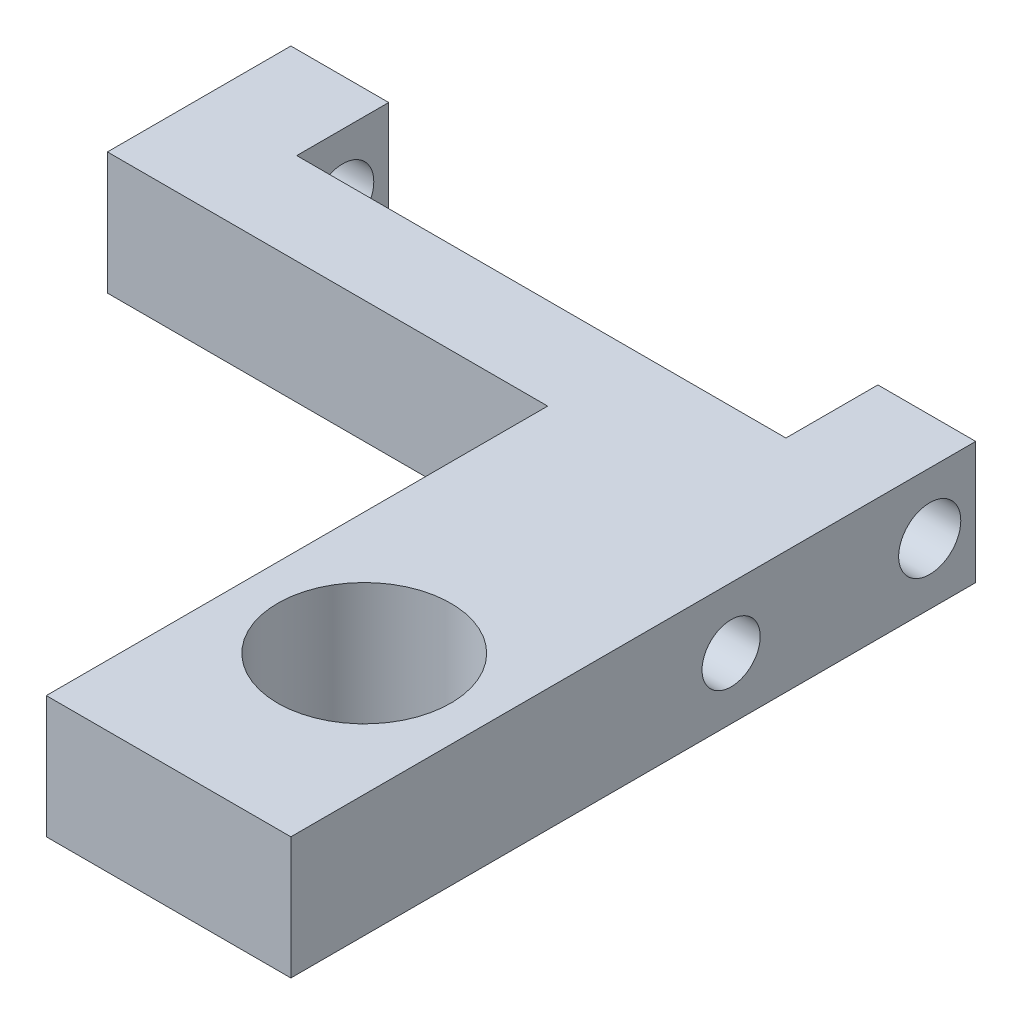
ISO-10303-21;
HEADER;
FILE_DESCRIPTION(('STEP AP214'),'2;1');
FILE_NAME('part.step','',(''),(''),'','','');
FILE_SCHEMA(('AUTOMOTIVE_DESIGN { 1 0 10303 214 1 1 1 1 }'));
ENDSEC;
DATA;
#1=APPLICATION_CONTEXT('core data for automotive mechanical design processes');
#2=APPLICATION_PROTOCOL_DEFINITION('international standard','automotive_design',2000,#1);
#3=PRODUCT_CONTEXT('',#1,'mechanical');
#4=PRODUCT('Part','Part','',(#3));
#5=PRODUCT_RELATED_PRODUCT_CATEGORY('part','',(#4));
#6=PRODUCT_DEFINITION_FORMATION('','',#4);
#7=PRODUCT_DEFINITION_CONTEXT('part definition',#1,'design');
#8=PRODUCT_DEFINITION('design','',#6,#7);
#9=PRODUCT_DEFINITION_SHAPE('','',#8);
#10=(LENGTH_UNIT() NAMED_UNIT(*) SI_UNIT(.MILLI.,.METRE.));
#11=(NAMED_UNIT(*) PLANE_ANGLE_UNIT() SI_UNIT($,.RADIAN.));
#12=(NAMED_UNIT(*) SI_UNIT($,.STERADIAN.) SOLID_ANGLE_UNIT());
#13=UNCERTAINTY_MEASURE_WITH_UNIT(LENGTH_MEASURE(1.E-05),#10,'distance_accuracy_value','');
#14=(GEOMETRIC_REPRESENTATION_CONTEXT(3) GLOBAL_UNCERTAINTY_ASSIGNED_CONTEXT((#13)) GLOBAL_UNIT_ASSIGNED_CONTEXT((#10,
#11,#12)) REPRESENTATION_CONTEXT('',''));
#15=CARTESIAN_POINT('',(0.,0.,0.));
#16=DIRECTION('',(0.,0.,1.));
#17=DIRECTION('',(1.,0.,0.));
#18=AXIS2_PLACEMENT_3D('',#15,#16,#17);
#19=CARTESIAN_POINT('',(-8.89,3.175,-8.89));
#20=DIRECTION('',(0.,0.,1.));
#21=DIRECTION('',(1.,0.,0.));
#22=AXIS2_PLACEMENT_3D('',#19,#20,#21);
#23=PLANE('',#22);
#24=DIRECTION('',(0.,-1.,0.));
#25=VECTOR('',#24,1.);
#26=CARTESIAN_POINT('',(6.34999999999999,3.175,-8.89));
#27=LINE('',#26,#25);
#28=CARTESIAN_POINT('',(6.34999999999999,3.175,-8.89));
#29=VERTEX_POINT('',#28);
#30=CARTESIAN_POINT('',(6.34999999999999,0.,-8.89));
#31=VERTEX_POINT('',#30);
#32=EDGE_CURVE('E173',#29,#31,#27,.T.);
#33=ORIENTED_EDGE('',*,*,#32,.F.);
#34=DIRECTION('',(-1.,0.,0.));
#35=VECTOR('',#34,1.);
#36=CARTESIAN_POINT('',(-8.89,3.175,-8.89));
#37=LINE('',#36,#35);
#38=CARTESIAN_POINT('',(8.89,3.175,-8.89));
#39=VERTEX_POINT('',#38);
#40=EDGE_CURVE('E185',#39,#29,#37,.T.);
#41=ORIENTED_EDGE('',*,*,#40,.F.);
#42=DIRECTION('',(0.,-1.,0.));
#43=VECTOR('',#42,1.);
#44=CARTESIAN_POINT('',(8.89,3.175,-8.89));
#45=LINE('',#44,#43);
#46=CARTESIAN_POINT('',(8.89,0.,-8.89));
#47=VERTEX_POINT('',#46);
#48=EDGE_CURVE('E208',#39,#47,#45,.T.);
#49=ORIENTED_EDGE('',*,*,#48,.T.);
#50=DIRECTION('',(-1.,0.,0.));
#51=VECTOR('',#50,1.);
#52=CARTESIAN_POINT('',(-8.89,0.,-8.89));
#53=LINE('',#52,#51);
#54=EDGE_CURVE('E197',#47,#31,#53,.T.);
#55=ORIENTED_EDGE('',*,*,#54,.T.);
#56=EDGE_LOOP('',(#33,#41,#49,#55));
#57=FACE_BOUND('',#56,.T.);
#58=ADVANCED_FACE('F35',(#57),#23,.F.);
#59=CARTESIAN_POINT('',(8.89,3.175,8.89));
#60=DIRECTION('',(-1.,0.,0.));
#61=DIRECTION('',(0.,0.,1.));
#62=AXIS2_PLACEMENT_3D('',#59,#60,#61);
#63=PLANE('',#62);
#64=CARTESIAN_POINT('',(8.89,1.5875,-2.54));
#65=DIRECTION('',(1.,0.,0.));
#66=DIRECTION('',(0.,0.,-1.));
#67=AXIS2_PLACEMENT_3D('',#64,#65,#66);
#68=CIRCLE('',#67,0.755649999999988);
#69=CARTESIAN_POINT('',(8.89,1.5875,-3.29564999999999));
#70=VERTEX_POINT('',#69);
#71=EDGE_CURVE('E142',#70,#70,#68,.T.);
#72=ORIENTED_EDGE('',*,*,#71,.F.);
#73=EDGE_LOOP('',(#72));
#74=FACE_BOUND('',#73,.T.);
#75=CARTESIAN_POINT('',(8.89,1.5875,-7.6962));
#76=DIRECTION('',(1.,0.,0.));
#77=DIRECTION('',(0.,0.,-1.));
#78=AXIS2_PLACEMENT_3D('',#75,#76,#77);
#79=CIRCLE('',#78,0.806449999999998);
#80=CARTESIAN_POINT('',(8.89,1.5875,-8.50265));
#81=VERTEX_POINT('',#80);
#82=EDGE_CURVE('E145',#81,#81,#79,.T.);
#83=ORIENTED_EDGE('',*,*,#82,.F.);
#84=EDGE_LOOP('',(#83));
#85=FACE_BOUND('',#84,.T.);
#86=DIRECTION('',(0.,0.,-1.));
#87=VECTOR('',#86,1.);
#88=CARTESIAN_POINT('',(8.89,0.,8.89));
#89=LINE('',#88,#87);
#90=CARTESIAN_POINT('',(8.89,0.,8.89));
#91=VERTEX_POINT('',#90);
#92=EDGE_CURVE('E180',#91,#47,#89,.T.);
#93=ORIENTED_EDGE('',*,*,#92,.T.);
#94=ORIENTED_EDGE('',*,*,#48,.F.);
#95=DIRECTION('',(0.,0.,-1.));
#96=VECTOR('',#95,1.);
#97=CARTESIAN_POINT('',(8.89,3.175,8.89));
#98=LINE('',#97,#96);
#99=CARTESIAN_POINT('',(8.89,3.175,8.89));
#100=VERTEX_POINT('',#99);
#101=EDGE_CURVE('E181',#100,#39,#98,.T.);
#102=ORIENTED_EDGE('',*,*,#101,.F.);
#103=DIRECTION('',(0.,-1.,0.));
#104=VECTOR('',#103,1.);
#105=CARTESIAN_POINT('',(8.89,3.175,8.89));
#106=LINE('',#105,#104);
#107=EDGE_CURVE('E193',#100,#91,#106,.T.);
#108=ORIENTED_EDGE('',*,*,#107,.T.);
#109=EDGE_LOOP('',(#93,#94,#102,#108));
#110=FACE_BOUND('',#109,.T.);
#111=ADVANCED_FACE('F37',(#74,#85,#110),#63,.F.);
#112=CARTESIAN_POINT('',(-6.35,3.175,-8.89));
#113=VERTEX_POINT('',#112);
#114=CARTESIAN_POINT('',(-8.89,3.175,-8.89));
#115=VERTEX_POINT('',#114);
#116=EDGE_CURVE('E184',#113,#115,#37,.T.);
#117=ORIENTED_EDGE('',*,*,#116,.F.);
#118=DIRECTION('',(0.,-1.,0.));
#119=VECTOR('',#118,1.);
#120=CARTESIAN_POINT('',(-6.35,3.175,-8.89));
#121=LINE('',#120,#119);
#122=CARTESIAN_POINT('',(-6.35,0.,-8.89));
#123=VERTEX_POINT('',#122);
#124=EDGE_CURVE('E177',#113,#123,#121,.T.);
#125=ORIENTED_EDGE('',*,*,#124,.T.);
#126=CARTESIAN_POINT('',(-8.89,0.,-8.89));
#127=VERTEX_POINT('',#126);
#128=EDGE_CURVE('E196',#123,#127,#53,.T.);
#129=ORIENTED_EDGE('',*,*,#128,.T.);
#130=DIRECTION('',(0.,-1.,0.));
#131=VECTOR('',#130,1.);
#132=CARTESIAN_POINT('',(-8.89,3.175,-8.89));
#133=LINE('',#132,#131);
#134=EDGE_CURVE('E205',#115,#127,#133,.T.);
#135=ORIENTED_EDGE('',*,*,#134,.F.);
#136=EDGE_LOOP('',(#117,#125,#129,#135));
#137=FACE_BOUND('',#136,.T.);
#138=ADVANCED_FACE('F243',(#137),#23,.F.);
#139=CARTESIAN_POINT('',(-8.89,3.175,8.89));
#140=DIRECTION('',(1.,0.,0.));
#141=DIRECTION('',(0.,0.,-1.));
#142=AXIS2_PLACEMENT_3D('',#139,#140,#141);
#143=PLANE('',#142);
#144=CARTESIAN_POINT('',(-8.89,1.5875,-7.6962));
#145=DIRECTION('',(1.,0.,0.));
#146=DIRECTION('',(0.,0.,-1.));
#147=AXIS2_PLACEMENT_3D('',#144,#145,#146);
#148=CIRCLE('',#147,0.806449999999995);
#149=CARTESIAN_POINT('',(-8.89,1.5875,-8.50264999999999));
#150=VERTEX_POINT('',#149);
#151=EDGE_CURVE('E148',#150,#150,#148,.T.);
#152=ORIENTED_EDGE('',*,*,#151,.T.);
#153=EDGE_LOOP('',(#152));
#154=FACE_BOUND('',#153,.T.);
#155=DIRECTION('',(0.,0.,1.));
#156=VECTOR('',#155,1.);
#157=CARTESIAN_POINT('',(-8.89,0.,8.89));
#158=LINE('',#157,#156);
#159=CARTESIAN_POINT('',(-8.89,0.,-4.1275));
#160=VERTEX_POINT('',#159);
#161=EDGE_CURVE('E200',#127,#160,#158,.T.);
#162=ORIENTED_EDGE('',*,*,#161,.T.);
#163=DIRECTION('',(0.,1.,0.));
#164=VECTOR('',#163,1.);
#165=CARTESIAN_POINT('',(-8.89,3.175,-4.1275));
#166=LINE('',#165,#164);
#167=CARTESIAN_POINT('',(-8.89,3.175,-4.1275));
#168=VERTEX_POINT('',#167);
#169=EDGE_CURVE('E52',#160,#168,#166,.T.);
#170=ORIENTED_EDGE('',*,*,#169,.T.);
#171=DIRECTION('',(0.,0.,1.));
#172=VECTOR('',#171,1.);
#173=CARTESIAN_POINT('',(-8.89,3.175,8.89));
#174=LINE('',#173,#172);
#175=EDGE_CURVE('E188',#115,#168,#174,.T.);
#176=ORIENTED_EDGE('',*,*,#175,.F.);
#177=ORIENTED_EDGE('',*,*,#134,.T.);
#178=EDGE_LOOP('',(#162,#170,#176,#177));
#179=FACE_BOUND('',#178,.T.);
#180=ADVANCED_FACE('F238',(#154,#179),#143,.F.);
#181=CARTESIAN_POINT('',(-8.89,3.175,8.89));
#182=DIRECTION('',(0.,0.,-1.));
#183=DIRECTION('',(-1.,0.,0.));
#184=AXIS2_PLACEMENT_3D('',#181,#182,#183);
#185=PLANE('',#184);
#186=DIRECTION('',(1.,0.,0.));
#187=VECTOR('',#186,1.);
#188=CARTESIAN_POINT('',(-8.89,3.175,8.89));
#189=LINE('',#188,#187);
#190=CARTESIAN_POINT('',(2.54,3.175,8.89));
#191=VERTEX_POINT('',#190);
#192=EDGE_CURVE('E191',#191,#100,#189,.T.);
#193=ORIENTED_EDGE('',*,*,#192,.F.);
#194=DIRECTION('',(0.,-1.,0.));
#195=VECTOR('',#194,1.);
#196=CARTESIAN_POINT('',(2.54,3.175,8.89));
#197=LINE('',#196,#195);
#198=CARTESIAN_POINT('',(2.54,0.,8.89));
#199=VERTEX_POINT('',#198);
#200=EDGE_CURVE('E139',#191,#199,#197,.T.);
#201=ORIENTED_EDGE('',*,*,#200,.T.);
#202=DIRECTION('',(1.,0.,0.));
#203=VECTOR('',#202,1.);
#204=CARTESIAN_POINT('',(-8.89,0.,8.89));
#205=LINE('',#204,#203);
#206=EDGE_CURVE('E133',#199,#91,#205,.T.);
#207=ORIENTED_EDGE('',*,*,#206,.T.);
#208=ORIENTED_EDGE('',*,*,#107,.F.);
#209=EDGE_LOOP('',(#193,#201,#207,#208));
#210=FACE_BOUND('',#209,.T.);
#211=ADVANCED_FACE('F233',(#210),#185,.F.);
#212=CARTESIAN_POINT('',(0.,3.175,0.));
#213=DIRECTION('',(0.,-1.,0.));
#214=DIRECTION('',(0.,0.,-1.));
#215=AXIS2_PLACEMENT_3D('',#212,#213,#214);
#216=PLANE('',#215);
#217=CARTESIAN_POINT('',(5.715,3.175,3.81));
#218=DIRECTION('',(0.,1.,0.));
#219=DIRECTION('',(0.,0.,1.));
#220=AXIS2_PLACEMENT_3D('',#217,#218,#219);
#221=CIRCLE('',#220,2.24789999999999);
#222=CARTESIAN_POINT('',(5.715,3.175,6.05789999999999));
#223=VERTEX_POINT('',#222);
#224=EDGE_CURVE('E155',#223,#223,#221,.T.);
#225=ORIENTED_EDGE('',*,*,#224,.F.);
#226=EDGE_LOOP('',(#225));
#227=FACE_BOUND('',#226,.T.);
#228=DIRECTION('',(-1.,0.,0.));
#229=VECTOR('',#228,1.);
#230=CARTESIAN_POINT('',(2.54,3.175,-4.1275));
#231=LINE('',#230,#229);
#232=CARTESIAN_POINT('',(2.54,3.175,-4.1275));
#233=VERTEX_POINT('',#232);
#234=EDGE_CURVE('E134',#233,#168,#231,.T.);
#235=ORIENTED_EDGE('',*,*,#234,.F.);
#236=DIRECTION('',(0.,0.,-1.));
#237=VECTOR('',#236,1.);
#238=CARTESIAN_POINT('',(2.54,3.175,-4.1275));
#239=LINE('',#238,#237);
#240=EDGE_CURVE('E120',#191,#233,#239,.T.);
#241=ORIENTED_EDGE('',*,*,#240,.F.);
#242=ORIENTED_EDGE('',*,*,#192,.T.);
#243=ORIENTED_EDGE('',*,*,#101,.T.);
#244=ORIENTED_EDGE('',*,*,#40,.T.);
#245=DIRECTION('',(0.,0.,1.));
#246=VECTOR('',#245,1.);
#247=CARTESIAN_POINT('',(6.34999999999999,3.175,-11.2776));
#248=LINE('',#247,#246);
#249=CARTESIAN_POINT('',(6.34999999999999,3.175,-6.5024));
#250=VERTEX_POINT('',#249);
#251=EDGE_CURVE('E166',#29,#250,#248,.T.);
#252=ORIENTED_EDGE('',*,*,#251,.T.);
#253=DIRECTION('',(1.,0.,0.));
#254=VECTOR('',#253,1.);
#255=CARTESIAN_POINT('',(-6.35,3.175,-6.5024));
#256=LINE('',#255,#254);
#257=CARTESIAN_POINT('',(-6.35,3.175,-6.5024));
#258=VERTEX_POINT('',#257);
#259=EDGE_CURVE('E168',#258,#250,#256,.T.);
#260=ORIENTED_EDGE('',*,*,#259,.F.);
#261=DIRECTION('',(0.,0.,1.));
#262=VECTOR('',#261,1.);
#263=CARTESIAN_POINT('',(-6.35,3.175,-11.2776));
#264=LINE('',#263,#262);
#265=EDGE_CURVE('E161',#113,#258,#264,.T.);
#266=ORIENTED_EDGE('',*,*,#265,.F.);
#267=ORIENTED_EDGE('',*,*,#116,.T.);
#268=ORIENTED_EDGE('',*,*,#175,.T.);
#269=EDGE_LOOP('',(#235,#241,#242,#243,#244,#252,#260,#266,#267,#268));
#270=FACE_BOUND('',#269,.T.);
#271=ADVANCED_FACE('F235',(#227,#270),#216,.F.);
#272=CARTESIAN_POINT('',(0.,0.,0.));
#273=DIRECTION('',(0.,-1.,0.));
#274=DIRECTION('',(0.,0.,-1.));
#275=AXIS2_PLACEMENT_3D('',#272,#273,#274);
#276=PLANE('',#275);
#277=DIRECTION('',(0.,0.,-1.));
#278=VECTOR('',#277,1.);
#279=CARTESIAN_POINT('',(2.54,0.,-4.1275));
#280=LINE('',#279,#278);
#281=CARTESIAN_POINT('',(2.54,0.,-4.1275));
#282=VERTEX_POINT('',#281);
#283=EDGE_CURVE('E117',#199,#282,#280,.T.);
#284=ORIENTED_EDGE('',*,*,#283,.T.);
#285=DIRECTION('',(-1.,0.,0.));
#286=VECTOR('',#285,1.);
#287=CARTESIAN_POINT('',(2.54,0.,-4.1275));
#288=LINE('',#287,#286);
#289=EDGE_CURVE('E122',#282,#160,#288,.T.);
#290=ORIENTED_EDGE('',*,*,#289,.T.);
#291=ORIENTED_EDGE('',*,*,#161,.F.);
#292=ORIENTED_EDGE('',*,*,#128,.F.);
#293=DIRECTION('',(0.,0.,-1.));
#294=VECTOR('',#293,1.);
#295=CARTESIAN_POINT('',(-6.35,0.,0.));
#296=LINE('',#295,#294);
#297=CARTESIAN_POINT('',(-6.35,0.,-6.5024));
#298=VERTEX_POINT('',#297);
#299=EDGE_CURVE('E11',#298,#123,#296,.T.);
#300=ORIENTED_EDGE('',*,*,#299,.F.);
#301=DIRECTION('',(1.,0.,0.));
#302=VECTOR('',#301,1.);
#303=CARTESIAN_POINT('',(-6.35,0.,-6.5024));
#304=LINE('',#303,#302);
#305=CARTESIAN_POINT('',(6.34999999999999,0.,-6.5024));
#306=VERTEX_POINT('',#305);
#307=EDGE_CURVE('E162',#298,#306,#304,.T.);
#308=ORIENTED_EDGE('',*,*,#307,.T.);
#309=DIRECTION('',(0.,0.,-1.));
#310=VECTOR('',#309,1.);
#311=CARTESIAN_POINT('',(6.34999999999999,0.,0.));
#312=LINE('',#311,#310);
#313=EDGE_CURVE('E44',#306,#31,#312,.T.);
#314=ORIENTED_EDGE('',*,*,#313,.T.);
#315=ORIENTED_EDGE('',*,*,#54,.F.);
#316=ORIENTED_EDGE('',*,*,#92,.F.);
#317=ORIENTED_EDGE('',*,*,#206,.F.);
#318=EDGE_LOOP('',(#284,#290,#291,#292,#300,#308,#314,#315,#316,#317));
#319=FACE_BOUND('',#318,.T.);
#320=CARTESIAN_POINT('',(5.715,0.,3.81));
#321=DIRECTION('',(0.,1.,0.));
#322=DIRECTION('',(0.,0.,1.));
#323=AXIS2_PLACEMENT_3D('',#320,#321,#322);
#324=CIRCLE('',#323,2.2479);
#325=CARTESIAN_POINT('',(5.715,0.,6.0579));
#326=VERTEX_POINT('',#325);
#327=EDGE_CURVE('E158',#326,#326,#324,.T.);
#328=ORIENTED_EDGE('',*,*,#327,.T.);
#329=EDGE_LOOP('',(#328));
#330=FACE_BOUND('',#329,.T.);
#331=ADVANCED_FACE('F130',(#319,#330),#276,.T.);
#332=CARTESIAN_POINT('',(-6.35,0.,-11.2776));
#333=DIRECTION('',(-1.,0.,0.));
#334=DIRECTION('',(0.,0.,1.));
#335=AXIS2_PLACEMENT_3D('',#332,#333,#334);
#336=PLANE('',#335);
#337=CARTESIAN_POINT('',(-6.35,1.5875,-7.6962));
#338=DIRECTION('',(-1.,0.,0.));
#339=DIRECTION('',(0.,0.,1.));
#340=AXIS2_PLACEMENT_3D('',#337,#338,#339);
#341=CIRCLE('',#340,0.806449999999997);
#342=CARTESIAN_POINT('',(-6.35,1.5875,-6.88975));
#343=VERTEX_POINT('',#342);
#344=EDGE_CURVE('E152',#343,#343,#341,.T.);
#345=ORIENTED_EDGE('',*,*,#344,.T.);
#346=EDGE_LOOP('',(#345));
#347=FACE_BOUND('',#346,.T.);
#348=ORIENTED_EDGE('',*,*,#265,.T.);
#349=DIRECTION('',(0.,1.,0.));
#350=VECTOR('',#349,1.);
#351=CARTESIAN_POINT('',(-6.35,0.,-6.5024));
#352=LINE('',#351,#350);
#353=EDGE_CURVE('E165',#298,#258,#352,.T.);
#354=ORIENTED_EDGE('',*,*,#353,.F.);
#355=ORIENTED_EDGE('',*,*,#299,.T.);
#356=ORIENTED_EDGE('',*,*,#124,.F.);
#357=EDGE_LOOP('',(#348,#354,#355,#356));
#358=FACE_BOUND('',#357,.T.);
#359=ADVANCED_FACE('F222',(#347,#358),#336,.F.);
#360=CARTESIAN_POINT('',(6.34999999999999,0.,-11.2776));
#361=DIRECTION('',(-1.,0.,0.));
#362=DIRECTION('',(0.,0.,1.));
#363=AXIS2_PLACEMENT_3D('',#360,#361,#362);
#364=PLANE('',#363);
#365=CARTESIAN_POINT('',(6.34999999999999,1.5875,-7.6962));
#366=DIRECTION('',(-1.,0.,0.));
#367=DIRECTION('',(0.,0.,1.));
#368=AXIS2_PLACEMENT_3D('',#365,#366,#367);
#369=CIRCLE('',#368,0.806449999999997);
#370=CARTESIAN_POINT('',(6.34999999999999,1.5875,-6.88975));
#371=VERTEX_POINT('',#370);
#372=EDGE_CURVE('E151',#371,#371,#369,.T.);
#373=ORIENTED_EDGE('',*,*,#372,.F.);
#374=EDGE_LOOP('',(#373));
#375=FACE_BOUND('',#374,.T.);
#376=ORIENTED_EDGE('',*,*,#32,.T.);
#377=ORIENTED_EDGE('',*,*,#313,.F.);
#378=DIRECTION('',(0.,1.,0.));
#379=VECTOR('',#378,1.);
#380=CARTESIAN_POINT('',(6.34999999999999,0.,-6.5024));
#381=LINE('',#380,#379);
#382=EDGE_CURVE('E60',#306,#250,#381,.T.);
#383=ORIENTED_EDGE('',*,*,#382,.T.);
#384=ORIENTED_EDGE('',*,*,#251,.F.);
#385=EDGE_LOOP('',(#376,#377,#383,#384));
#386=FACE_BOUND('',#385,.T.);
#387=ADVANCED_FACE('F218',(#375,#386),#364,.T.);
#388=CARTESIAN_POINT('',(-6.35,0.,-6.5024));
#389=DIRECTION('',(0.,0.,1.));
#390=DIRECTION('',(1.,0.,0.));
#391=AXIS2_PLACEMENT_3D('',#388,#389,#390);
#392=PLANE('',#391);
#393=ORIENTED_EDGE('',*,*,#259,.T.);
#394=ORIENTED_EDGE('',*,*,#382,.F.);
#395=ORIENTED_EDGE('',*,*,#307,.F.);
#396=ORIENTED_EDGE('',*,*,#353,.T.);
#397=EDGE_LOOP('',(#393,#394,#395,#396));
#398=FACE_BOUND('',#397,.T.);
#399=ADVANCED_FACE('F221',(#398),#392,.F.);
#400=CARTESIAN_POINT('',(5.715,3.175,3.81));
#401=DIRECTION('',(0.,1.,0.));
#402=DIRECTION('',(0.,0.,1.));
#403=AXIS2_PLACEMENT_3D('',#400,#401,#402);
#404=CYLINDRICAL_SURFACE('',#403,2.24789999999999);
#405=ORIENTED_EDGE('',*,*,#327,.F.);
#406=EDGE_LOOP('',(#405));
#407=FACE_BOUND('',#406,.T.);
#408=ORIENTED_EDGE('',*,*,#224,.T.);
#409=EDGE_LOOP('',(#408));
#410=FACE_BOUND('',#409,.T.);
#411=ADVANCED_FACE('F248',(#407,#410),#404,.F.);
#412=CARTESIAN_POINT('',(8.89,1.5875,-7.6962));
#413=DIRECTION('',(1.,0.,0.));
#414=DIRECTION('',(0.,0.,-1.));
#415=AXIS2_PLACEMENT_3D('',#412,#413,#414);
#416=CYLINDRICAL_SURFACE('',#415,0.806449999999997);
#417=ORIENTED_EDGE('',*,*,#372,.T.);
#418=EDGE_LOOP('',(#417));
#419=FACE_BOUND('',#418,.T.);
#420=ORIENTED_EDGE('',*,*,#82,.T.);
#421=EDGE_LOOP('',(#420));
#422=FACE_BOUND('',#421,.T.);
#423=ADVANCED_FACE('F215',(#419,#422),#416,.F.);
#424=ORIENTED_EDGE('',*,*,#151,.F.);
#425=EDGE_LOOP('',(#424));
#426=FACE_BOUND('',#425,.T.);
#427=ORIENTED_EDGE('',*,*,#344,.F.);
#428=EDGE_LOOP('',(#427));
#429=FACE_BOUND('',#428,.T.);
#430=ADVANCED_FACE('F282',(#426,#429),#416,.F.);
#431=CARTESIAN_POINT('',(8.89,1.5875,-2.54));
#432=DIRECTION('',(1.,0.,0.));
#433=DIRECTION('',(0.,0.,-1.));
#434=AXIS2_PLACEMENT_3D('',#431,#432,#433);
#435=CYLINDRICAL_SURFACE('',#434,0.755649999999992);
#436=CARTESIAN_POINT('',(2.54,1.5875,-2.54));
#437=DIRECTION('',(1.,0.,0.));
#438=DIRECTION('',(0.,0.,-1.));
#439=AXIS2_PLACEMENT_3D('',#436,#437,#438);
#440=CIRCLE('',#439,0.755649999999992);
#441=CARTESIAN_POINT('',(2.54,1.5875,-3.29564999999999));
#442=VERTEX_POINT('',#441);
#443=EDGE_CURVE('E39',#442,#442,#440,.F.);
#444=ORIENTED_EDGE('',*,*,#443,.T.);
#445=EDGE_LOOP('',(#444));
#446=FACE_BOUND('',#445,.T.);
#447=ORIENTED_EDGE('',*,*,#71,.T.);
#448=EDGE_LOOP('',(#447));
#449=FACE_BOUND('',#448,.T.);
#450=ADVANCED_FACE('F284',(#446,#449),#435,.F.);
#451=CARTESIAN_POINT('',(2.54,0.,-4.1275));
#452=DIRECTION('',(0.,0.,-1.));
#453=DIRECTION('',(-1.,0.,0.));
#454=AXIS2_PLACEMENT_3D('',#451,#452,#453);
#455=PLANE('',#454);
#456=ORIENTED_EDGE('',*,*,#289,.F.);
#457=DIRECTION('',(0.,1.,0.));
#458=VECTOR('',#457,1.);
#459=CARTESIAN_POINT('',(2.54,0.,-4.1275));
#460=LINE('',#459,#458);
#461=EDGE_CURVE('E114',#282,#233,#460,.T.);
#462=ORIENTED_EDGE('',*,*,#461,.T.);
#463=ORIENTED_EDGE('',*,*,#234,.T.);
#464=ORIENTED_EDGE('',*,*,#169,.F.);
#465=EDGE_LOOP('',(#456,#462,#463,#464));
#466=FACE_BOUND('',#465,.T.);
#467=ADVANCED_FACE('F124',(#466),#455,.F.);
#468=CARTESIAN_POINT('',(2.54,0.,-4.1275));
#469=DIRECTION('',(1.,0.,0.));
#470=DIRECTION('',(0.,0.,-1.));
#471=AXIS2_PLACEMENT_3D('',#468,#469,#470);
#472=PLANE('',#471);
#473=ORIENTED_EDGE('',*,*,#443,.F.);
#474=EDGE_LOOP('',(#473));
#475=FACE_BOUND('',#474,.T.);
#476=ORIENTED_EDGE('',*,*,#240,.T.);
#477=ORIENTED_EDGE('',*,*,#461,.F.);
#478=ORIENTED_EDGE('',*,*,#283,.F.);
#479=ORIENTED_EDGE('',*,*,#200,.F.);
#480=EDGE_LOOP('',(#476,#477,#478,#479));
#481=FACE_BOUND('',#480,.T.);
#482=ADVANCED_FACE('F115',(#475,#481),#472,.F.);
#483=CLOSED_SHELL('',(#58,#111,#138,#180,#211,#271,#331,#359,#387,#399,#411,#423,#430,#450,#467,#482));
#484=MANIFOLD_SOLID_BREP('B2',#483);
#485=ADVANCED_BREP_SHAPE_REPRESENTATION('',(#18,#484),#14);
#486=SHAPE_DEFINITION_REPRESENTATION(#9,#485);
ENDSEC;
END-ISO-10303-21;
